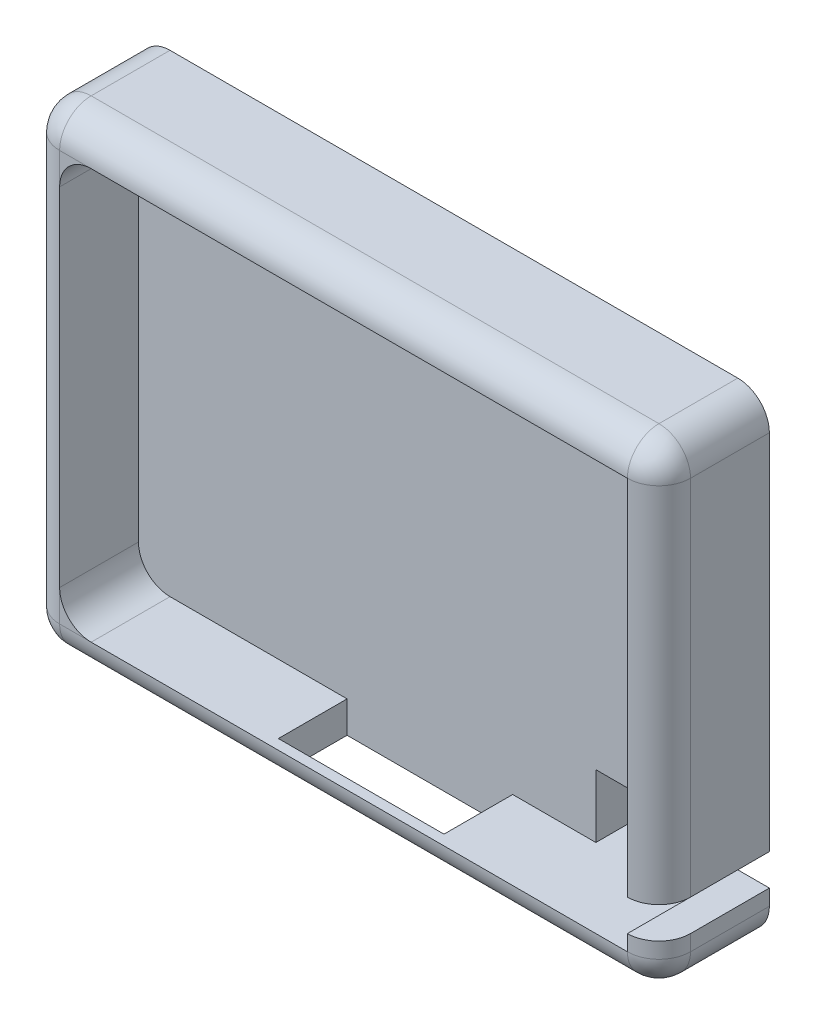
ISO-10303-21;
HEADER;
FILE_DESCRIPTION(('STEP AP214'),'2;1');
FILE_NAME('part.step','',(''),(''),'','','');
FILE_SCHEMA(('AUTOMOTIVE_DESIGN { 1 0 10303 214 1 1 1 1 }'));
ENDSEC;
DATA;
#1=APPLICATION_CONTEXT('core data for automotive mechanical design processes');
#2=APPLICATION_PROTOCOL_DEFINITION('international standard','automotive_design',2000,#1);
#3=PRODUCT_CONTEXT('',#1,'mechanical');
#4=PRODUCT('Part','Part','',(#3));
#5=PRODUCT_RELATED_PRODUCT_CATEGORY('part','',(#4));
#6=PRODUCT_DEFINITION_FORMATION('','',#4);
#7=PRODUCT_DEFINITION_CONTEXT('part definition',#1,'design');
#8=PRODUCT_DEFINITION('design','',#6,#7);
#9=PRODUCT_DEFINITION_SHAPE('','',#8);
#10=(LENGTH_UNIT() NAMED_UNIT(*) SI_UNIT(.MILLI.,.METRE.));
#11=(NAMED_UNIT(*) PLANE_ANGLE_UNIT() SI_UNIT($,.RADIAN.));
#12=(NAMED_UNIT(*) SI_UNIT($,.STERADIAN.) SOLID_ANGLE_UNIT());
#13=UNCERTAINTY_MEASURE_WITH_UNIT(LENGTH_MEASURE(1.E-05),#10,'distance_accuracy_value','');
#14=(GEOMETRIC_REPRESENTATION_CONTEXT(3) GLOBAL_UNCERTAINTY_ASSIGNED_CONTEXT((#13)) GLOBAL_UNIT_ASSIGNED_CONTEXT((#10,
#11,#12)) REPRESENTATION_CONTEXT('',''));
#15=CARTESIAN_POINT('',(0.,0.,0.));
#16=DIRECTION('',(0.,0.,1.));
#17=DIRECTION('',(1.,0.,0.));
#18=AXIS2_PLACEMENT_3D('',#15,#16,#17);
#19=CARTESIAN_POINT('',(40.,0.,7.));
#20=DIRECTION('',(-1.,0.,0.));
#21=DIRECTION('',(0.,0.,1.));
#22=AXIS2_PLACEMENT_3D('',#19,#20,#21);
#23=PLANE('',#22);
#24=DIRECTION('',(0.,1.,0.));
#25=VECTOR('',#24,1.);
#26=CARTESIAN_POINT('',(40.,0.,0.));
#27=LINE('',#26,#25);
#28=CARTESIAN_POINT('',(40.,2.,0.));
#29=VERTEX_POINT('',#28);
#30=CARTESIAN_POINT('',(40.,3.,0.));
#31=VERTEX_POINT('',#30);
#32=EDGE_CURVE('E290',#29,#31,#27,.T.);
#33=ORIENTED_EDGE('',*,*,#32,.T.);
#34=DIRECTION('',(0.,0.,-1.));
#35=VECTOR('',#34,1.);
#36=CARTESIAN_POINT('',(40.,3.,10.));
#37=LINE('',#36,#35);
#38=CARTESIAN_POINT('',(40.,3.,5.));
#39=VERTEX_POINT('',#38);
#40=EDGE_CURVE('E469',#39,#31,#37,.T.);
#41=ORIENTED_EDGE('',*,*,#40,.F.);
#42=DIRECTION('',(0.,1.,0.));
#43=VECTOR('',#42,1.);
#44=CARTESIAN_POINT('',(40.,0.,5.));
#45=LINE('',#44,#43);
#46=CARTESIAN_POINT('',(40.,2.,5.));
#47=VERTEX_POINT('',#46);
#48=EDGE_CURVE('E333',#39,#47,#45,.F.);
#49=ORIENTED_EDGE('',*,*,#48,.T.);
#50=DIRECTION('',(0.,0.,-1.));
#51=VECTOR('',#50,1.);
#52=CARTESIAN_POINT('',(40.,2.,7.));
#53=LINE('',#52,#51);
#54=EDGE_CURVE('E337',#47,#29,#53,.T.);
#55=ORIENTED_EDGE('',*,*,#54,.T.);
#56=EDGE_LOOP('',(#33,#41,#49,#55));
#57=FACE_BOUND('',#56,.T.);
#58=ADVANCED_FACE('F34',(#57),#23,.F.);
#59=CARTESIAN_POINT('',(38.,28.,2.));
#60=DIRECTION('',(1.,0.,0.));
#61=DIRECTION('',(0.,0.,-1.));
#62=AXIS2_PLACEMENT_3D('',#59,#60,#61);
#63=PLANE('',#62);
#64=DIRECTION('',(0.,1.,0.));
#65=VECTOR('',#64,1.);
#66=CARTESIAN_POINT('',(38.,28.,7.));
#67=LINE('',#66,#65);
#68=CARTESIAN_POINT('',(38.,2.,7.));
#69=VERTEX_POINT('',#68);
#70=CARTESIAN_POINT('',(38.,3.,7.));
#71=VERTEX_POINT('',#70);
#72=EDGE_CURVE('E268',#69,#71,#67,.T.);
#73=ORIENTED_EDGE('',*,*,#72,.T.);
#74=DIRECTION('',(0.,0.,-1.));
#75=VECTOR('',#74,1.);
#76=CARTESIAN_POINT('',(38.,3.,10.));
#77=LINE('',#76,#75);
#78=CARTESIAN_POINT('',(38.,3.,0.));
#79=VERTEX_POINT('',#78);
#80=EDGE_CURVE('E56',#71,#79,#77,.T.);
#81=ORIENTED_EDGE('',*,*,#80,.T.);
#82=DIRECTION('',(0.,1.,0.));
#83=VECTOR('',#82,1.);
#84=CARTESIAN_POINT('',(38.,2.,0.));
#85=LINE('',#84,#83);
#86=CARTESIAN_POINT('',(38.,2.,0.));
#87=VERTEX_POINT('',#86);
#88=EDGE_CURVE('E233',#87,#79,#85,.T.);
#89=ORIENTED_EDGE('',*,*,#88,.F.);
#90=DIRECTION('',(0.,0.,1.));
#91=VECTOR('',#90,1.);
#92=CARTESIAN_POINT('',(38.,2.,2.));
#93=LINE('',#92,#91);
#94=EDGE_CURVE('E279',#87,#69,#93,.T.);
#95=ORIENTED_EDGE('',*,*,#94,.T.);
#96=EDGE_LOOP('',(#73,#81,#89,#95));
#97=FACE_BOUND('',#96,.T.);
#98=ADVANCED_FACE('F467',(#97),#63,.F.);
#99=CARTESIAN_POINT('',(38.,0.,5.));
#100=DIRECTION('',(0.,1.,0.));
#101=DIRECTION('',(0.,0.,1.));
#102=AXIS2_PLACEMENT_3D('',#99,#100,#101);
#103=CYLINDRICAL_SURFACE('',#102,2.);
#104=CARTESIAN_POINT('',(38.,3.,5.));
#105=DIRECTION('',(0.,-1.,0.));
#106=DIRECTION('',(0.,0.,-1.));
#107=AXIS2_PLACEMENT_3D('',#104,#105,#106);
#108=CIRCLE('',#107,2.);
#109=EDGE_CURVE('E11',#71,#39,#108,.F.);
#110=ORIENTED_EDGE('',*,*,#109,.F.);
#111=ORIENTED_EDGE('',*,*,#72,.F.);
#112=CARTESIAN_POINT('',(38.,2.,5.));
#113=DIRECTION('',(0.,-1.,0.));
#114=DIRECTION('',(0.,0.,-1.));
#115=AXIS2_PLACEMENT_3D('',#112,#113,#114);
#116=CIRCLE('',#115,2.);
#117=EDGE_CURVE('E368',#47,#69,#116,.T.);
#118=ORIENTED_EDGE('',*,*,#117,.F.);
#119=ORIENTED_EDGE('',*,*,#48,.F.);
#120=EDGE_LOOP('',(#110,#111,#118,#119));
#121=FACE_BOUND('',#120,.T.);
#122=ADVANCED_FACE('F543',(#121),#103,.T.);
#123=CARTESIAN_POINT('',(0.,0.,7.));
#124=DIRECTION('',(0.,0.,-1.));
#125=DIRECTION('',(-1.,0.,0.));
#126=AXIS2_PLACEMENT_3D('',#123,#124,#125);
#127=PLANE('',#126);
#128=CARTESIAN_POINT('',(4.,26.,7.));
#129=DIRECTION('',(0.,0.,-1.));
#130=DIRECTION('',(-1.,0.,0.));
#131=AXIS2_PLACEMENT_3D('',#128,#129,#130);
#132=CIRCLE('',#131,2.);
#133=CARTESIAN_POINT('',(2.,26.,7.));
#134=VERTEX_POINT('',#133);
#135=CARTESIAN_POINT('',(4.,28.,7.));
#136=VERTEX_POINT('',#135);
#137=EDGE_CURVE('E312',#134,#136,#132,.T.);
#138=ORIENTED_EDGE('',*,*,#137,.T.);
#139=DIRECTION('',(-1.,0.,0.));
#140=VECTOR('',#139,1.);
#141=CARTESIAN_POINT('',(0.,28.,7.));
#142=LINE('',#141,#140);
#143=CARTESIAN_POINT('',(2.,28.,7.));
#144=VERTEX_POINT('',#143);
#145=EDGE_CURVE('E321',#136,#144,#142,.T.);
#146=ORIENTED_EDGE('',*,*,#145,.T.);
#147=DIRECTION('',(0.,-1.,0.));
#148=VECTOR('',#147,1.);
#149=CARTESIAN_POINT('',(2.,0.,7.));
#150=LINE('',#149,#148);
#151=EDGE_CURVE('E319',#144,#134,#150,.T.);
#152=ORIENTED_EDGE('',*,*,#151,.T.);
#153=EDGE_LOOP('',(#138,#146,#152));
#154=FACE_BOUND('',#153,.T.);
#155=ADVANCED_FACE('F519',(#154),#127,.F.);
#156=CARTESIAN_POINT('',(0.,0.,7.));
#157=DIRECTION('',(1.,0.,0.));
#158=DIRECTION('',(0.,0.,-1.));
#159=AXIS2_PLACEMENT_3D('',#156,#157,#158);
#160=PLANE('',#159);
#161=DIRECTION('',(0.,-1.,0.));
#162=VECTOR('',#161,1.);
#163=CARTESIAN_POINT('',(0.,0.,0.));
#164=LINE('',#163,#162);
#165=CARTESIAN_POINT('',(0.,28.,0.));
#166=VERTEX_POINT('',#165);
#167=CARTESIAN_POINT('',(0.,2.,0.));
#168=VERTEX_POINT('',#167);
#169=EDGE_CURVE('E282',#166,#168,#164,.T.);
#170=ORIENTED_EDGE('',*,*,#169,.T.);
#171=DIRECTION('',(0.,0.,-1.));
#172=VECTOR('',#171,1.);
#173=CARTESIAN_POINT('',(0.,2.,7.));
#174=LINE('',#173,#172);
#175=CARTESIAN_POINT('',(0.,2.,5.));
#176=VERTEX_POINT('',#175);
#177=EDGE_CURVE('E349',#168,#176,#174,.F.);
#178=ORIENTED_EDGE('',*,*,#177,.T.);
#179=DIRECTION('',(0.,-1.,0.));
#180=VECTOR('',#179,1.);
#181=CARTESIAN_POINT('',(0.,0.,5.));
#182=LINE('',#181,#180);
#183=CARTESIAN_POINT('',(0.,28.,5.));
#184=VERTEX_POINT('',#183);
#185=EDGE_CURVE('E347',#176,#184,#182,.F.);
#186=ORIENTED_EDGE('',*,*,#185,.T.);
#187=DIRECTION('',(0.,0.,-1.));
#188=VECTOR('',#187,1.);
#189=CARTESIAN_POINT('',(0.,28.,7.));
#190=LINE('',#189,#188);
#191=EDGE_CURVE('E345',#184,#166,#190,.T.);
#192=ORIENTED_EDGE('',*,*,#191,.T.);
#193=EDGE_LOOP('',(#170,#178,#186,#192));
#194=FACE_BOUND('',#193,.T.);
#195=ADVANCED_FACE('F576',(#194),#160,.F.);
#196=CARTESIAN_POINT('',(0.,0.,7.));
#197=DIRECTION('',(0.,1.,0.));
#198=DIRECTION('',(0.,0.,1.));
#199=AXIS2_PLACEMENT_3D('',#196,#197,#198);
#200=PLANE('',#199);
#201=DIRECTION('',(1.,0.,0.));
#202=VECTOR('',#201,1.);
#203=CARTESIAN_POINT('',(0.,0.,5.));
#204=LINE('',#203,#202);
#205=CARTESIAN_POINT('',(38.,0.,5.));
#206=VERTEX_POINT('',#205);
#207=CARTESIAN_POINT('',(25.7257710311441,0.,5.));
#208=VERTEX_POINT('',#207);
#209=EDGE_CURVE('E326',#206,#208,#204,.F.);
#210=ORIENTED_EDGE('',*,*,#209,.T.);
#211=DIRECTION('',(0.,0.,1.));
#212=VECTOR('',#211,1.);
#213=CARTESIAN_POINT('',(25.7257710311441,0.,2.));
#214=LINE('',#213,#212);
#215=CARTESIAN_POINT('',(25.7257710311441,0.,2.));
#216=VERTEX_POINT('',#215);
#217=EDGE_CURVE('E408',#216,#208,#214,.T.);
#218=ORIENTED_EDGE('',*,*,#217,.F.);
#219=DIRECTION('',(1.,0.,0.));
#220=VECTOR('',#219,1.);
#221=CARTESIAN_POINT('',(15.2257710311441,0.,2.));
#222=LINE('',#221,#220);
#223=CARTESIAN_POINT('',(15.2257710311441,0.,2.));
#224=VERTEX_POINT('',#223);
#225=EDGE_CURVE('E431',#224,#216,#222,.T.);
#226=ORIENTED_EDGE('',*,*,#225,.F.);
#227=DIRECTION('',(0.,0.,-1.));
#228=VECTOR('',#227,1.);
#229=CARTESIAN_POINT('',(15.2257710311441,0.,2.));
#230=LINE('',#229,#228);
#231=CARTESIAN_POINT('',(15.2257710311441,0.,5.));
#232=VERTEX_POINT('',#231);
#233=EDGE_CURVE('E418',#232,#224,#230,.T.);
#234=ORIENTED_EDGE('',*,*,#233,.F.);
#235=CARTESIAN_POINT('',(2.,0.,5.));
#236=VERTEX_POINT('',#235);
#237=EDGE_CURVE('E325',#232,#236,#204,.F.);
#238=ORIENTED_EDGE('',*,*,#237,.T.);
#239=DIRECTION('',(0.,0.,-1.));
#240=VECTOR('',#239,1.);
#241=CARTESIAN_POINT('',(2.,0.,7.));
#242=LINE('',#241,#240);
#243=CARTESIAN_POINT('',(2.,0.,0.));
#244=VERTEX_POINT('',#243);
#245=EDGE_CURVE('E329',#236,#244,#242,.T.);
#246=ORIENTED_EDGE('',*,*,#245,.T.);
#247=DIRECTION('',(1.,0.,0.));
#248=VECTOR('',#247,1.);
#249=CARTESIAN_POINT('',(0.,0.,0.));
#250=LINE('',#249,#248);
#251=CARTESIAN_POINT('',(38.,0.,0.));
#252=VERTEX_POINT('',#251);
#253=EDGE_CURVE('E287',#244,#252,#250,.T.);
#254=ORIENTED_EDGE('',*,*,#253,.T.);
#255=DIRECTION('',(0.,0.,-1.));
#256=VECTOR('',#255,1.);
#257=CARTESIAN_POINT('',(38.,0.,7.));
#258=LINE('',#257,#256);
#259=EDGE_CURVE('E323',#252,#206,#258,.F.);
#260=ORIENTED_EDGE('',*,*,#259,.T.);
#261=EDGE_LOOP('',(#210,#218,#226,#234,#238,#246,#254,#260));
#262=FACE_BOUND('',#261,.T.);
#263=ADVANCED_FACE('F430',(#262),#200,.F.);
#264=CARTESIAN_POINT('',(40.,28.,5.));
#265=VERTEX_POINT('',#264);
#266=CARTESIAN_POINT('',(40.,5.,5.));
#267=VERTEX_POINT('',#266);
#268=EDGE_CURVE('E334',#265,#267,#45,.F.);
#269=ORIENTED_EDGE('',*,*,#268,.T.);
#270=DIRECTION('',(0.,0.,-1.));
#271=VECTOR('',#270,1.);
#272=CARTESIAN_POINT('',(40.,5.,10.));
#273=LINE('',#272,#271);
#274=CARTESIAN_POINT('',(40.,5.,0.));
#275=VERTEX_POINT('',#274);
#276=EDGE_CURVE('E49',#267,#275,#273,.T.);
#277=ORIENTED_EDGE('',*,*,#276,.T.);
#278=CARTESIAN_POINT('',(40.,28.,0.));
#279=VERTEX_POINT('',#278);
#280=EDGE_CURVE('E227',#275,#279,#27,.T.);
#281=ORIENTED_EDGE('',*,*,#280,.T.);
#282=DIRECTION('',(0.,0.,-1.));
#283=VECTOR('',#282,1.);
#284=CARTESIAN_POINT('',(40.,28.,7.));
#285=LINE('',#284,#283);
#286=EDGE_CURVE('E331',#279,#265,#285,.F.);
#287=ORIENTED_EDGE('',*,*,#286,.T.);
#288=EDGE_LOOP('',(#269,#277,#281,#287));
#289=FACE_BOUND('',#288,.T.);
#290=ADVANCED_FACE('F474',(#289),#23,.F.);
#291=CARTESIAN_POINT('',(0.,30.,7.));
#292=DIRECTION('',(0.,-1.,0.));
#293=DIRECTION('',(0.,0.,-1.));
#294=AXIS2_PLACEMENT_3D('',#291,#292,#293);
#295=PLANE('',#294);
#296=DIRECTION('',(-1.,0.,0.));
#297=VECTOR('',#296,1.);
#298=CARTESIAN_POINT('',(0.,30.,5.));
#299=LINE('',#298,#297);
#300=CARTESIAN_POINT('',(2.,30.,5.));
#301=VERTEX_POINT('',#300);
#302=CARTESIAN_POINT('',(38.,30.,5.));
#303=VERTEX_POINT('',#302);
#304=EDGE_CURVE('E341',#301,#303,#299,.F.);
#305=ORIENTED_EDGE('',*,*,#304,.T.);
#306=DIRECTION('',(0.,0.,-1.));
#307=VECTOR('',#306,1.);
#308=CARTESIAN_POINT('',(38.,30.,7.));
#309=LINE('',#308,#307);
#310=CARTESIAN_POINT('',(38.,30.,0.));
#311=VERTEX_POINT('',#310);
#312=EDGE_CURVE('E343',#303,#311,#309,.T.);
#313=ORIENTED_EDGE('',*,*,#312,.T.);
#314=DIRECTION('',(-1.,0.,0.));
#315=VECTOR('',#314,1.);
#316=CARTESIAN_POINT('',(0.,30.,0.));
#317=LINE('',#316,#315);
#318=CARTESIAN_POINT('',(2.,30.,0.));
#319=VERTEX_POINT('',#318);
#320=EDGE_CURVE('E293',#311,#319,#317,.T.);
#321=ORIENTED_EDGE('',*,*,#320,.T.);
#322=DIRECTION('',(0.,0.,-1.));
#323=VECTOR('',#322,1.);
#324=CARTESIAN_POINT('',(2.,30.,7.));
#325=LINE('',#324,#323);
#326=EDGE_CURVE('E339',#319,#301,#325,.F.);
#327=ORIENTED_EDGE('',*,*,#326,.T.);
#328=EDGE_LOOP('',(#305,#313,#321,#327));
#329=FACE_BOUND('',#328,.T.);
#330=ADVANCED_FACE('F501',(#329),#295,.F.);
#331=DIRECTION('',(0.,-1.,0.));
#332=VECTOR('',#331,1.);
#333=CARTESIAN_POINT('',(2.,0.,7.));
#334=LINE('',#333,#332);
#335=CARTESIAN_POINT('',(2.,4.,7.));
#336=VERTEX_POINT('',#335);
#337=CARTESIAN_POINT('',(2.,2.,7.));
#338=VERTEX_POINT('',#337);
#339=EDGE_CURVE('E314',#336,#338,#334,.T.);
#340=ORIENTED_EDGE('',*,*,#339,.T.);
#341=DIRECTION('',(1.,0.,0.));
#342=VECTOR('',#341,1.);
#343=CARTESIAN_POINT('',(0.,2.,7.));
#344=LINE('',#343,#342);
#345=CARTESIAN_POINT('',(4.,2.,7.));
#346=VERTEX_POINT('',#345);
#347=EDGE_CURVE('E316',#338,#346,#344,.T.);
#348=ORIENTED_EDGE('',*,*,#347,.T.);
#349=CARTESIAN_POINT('',(4.,4.,7.));
#350=DIRECTION('',(0.,0.,-1.));
#351=DIRECTION('',(-1.,0.,0.));
#352=AXIS2_PLACEMENT_3D('',#349,#350,#351);
#353=CIRCLE('',#352,2.);
#354=EDGE_CURVE('E310',#346,#336,#353,.T.);
#355=ORIENTED_EDGE('',*,*,#354,.T.);
#356=EDGE_LOOP('',(#340,#348,#355));
#357=FACE_BOUND('',#356,.T.);
#358=ADVANCED_FACE('F575',(#357),#127,.F.);
#359=CARTESIAN_POINT('',(0.,0.,0.));
#360=DIRECTION('',(0.,0.,-1.));
#361=DIRECTION('',(-1.,0.,0.));
#362=AXIS2_PLACEMENT_3D('',#359,#360,#361);
#363=PLANE('',#362);
#364=DIRECTION('',(-1.,0.,0.));
#365=VECTOR('',#364,1.);
#366=CARTESIAN_POINT('',(38.,3.,0.));
#367=LINE('',#366,#365);
#368=EDGE_CURVE('E217',#31,#79,#367,.T.);
#369=ORIENTED_EDGE('',*,*,#368,.F.);
#370=ORIENTED_EDGE('',*,*,#32,.F.);
#371=CARTESIAN_POINT('',(38.,2.,0.));
#372=DIRECTION('',(0.,0.,-1.));
#373=DIRECTION('',(-1.,0.,0.));
#374=AXIS2_PLACEMENT_3D('',#371,#372,#373);
#375=CIRCLE('',#374,2.);
#376=EDGE_CURVE('E355',#29,#252,#375,.T.);
#377=ORIENTED_EDGE('',*,*,#376,.T.);
#378=ORIENTED_EDGE('',*,*,#253,.F.);
#379=CARTESIAN_POINT('',(2.,2.,0.));
#380=DIRECTION('',(0.,0.,-1.));
#381=DIRECTION('',(-1.,0.,0.));
#382=AXIS2_PLACEMENT_3D('',#379,#380,#381);
#383=CIRCLE('',#382,2.);
#384=EDGE_CURVE('E357',#244,#168,#383,.T.);
#385=ORIENTED_EDGE('',*,*,#384,.T.);
#386=ORIENTED_EDGE('',*,*,#169,.F.);
#387=CARTESIAN_POINT('',(2.,28.,0.));
#388=DIRECTION('',(0.,0.,-1.));
#389=DIRECTION('',(-1.,0.,0.));
#390=AXIS2_PLACEMENT_3D('',#387,#388,#389);
#391=CIRCLE('',#390,2.);
#392=EDGE_CURVE('E351',#166,#319,#391,.T.);
#393=ORIENTED_EDGE('',*,*,#392,.T.);
#394=ORIENTED_EDGE('',*,*,#320,.F.);
#395=CARTESIAN_POINT('',(38.,28.,0.));
#396=DIRECTION('',(0.,0.,-1.));
#397=DIRECTION('',(-1.,0.,0.));
#398=AXIS2_PLACEMENT_3D('',#395,#396,#397);
#399=CIRCLE('',#398,2.);
#400=EDGE_CURVE('E353',#311,#279,#399,.T.);
#401=ORIENTED_EDGE('',*,*,#400,.T.);
#402=ORIENTED_EDGE('',*,*,#280,.F.);
#403=DIRECTION('',(1.,0.,0.));
#404=VECTOR('',#403,1.);
#405=CARTESIAN_POINT('',(38.,5.,0.));
#406=LINE('',#405,#404);
#407=CARTESIAN_POINT('',(38.,5.,0.));
#408=VERTEX_POINT('',#407);
#409=EDGE_CURVE('E213',#408,#275,#406,.T.);
#410=ORIENTED_EDGE('',*,*,#409,.F.);
#411=CARTESIAN_POINT('',(38.,6.,0.));
#412=VERTEX_POINT('',#411);
#413=EDGE_CURVE('E224',#408,#412,#85,.T.);
#414=ORIENTED_EDGE('',*,*,#413,.T.);
#415=DIRECTION('',(-1.,0.,0.));
#416=VECTOR('',#415,1.);
#417=CARTESIAN_POINT('',(38.,6.,0.));
#418=LINE('',#417,#416);
#419=CARTESIAN_POINT('',(31.,6.,0.));
#420=VERTEX_POINT('',#419);
#421=EDGE_CURVE('E241',#412,#420,#418,.T.);
#422=ORIENTED_EDGE('',*,*,#421,.T.);
#423=DIRECTION('',(0.,-1.,0.));
#424=VECTOR('',#423,1.);
#425=CARTESIAN_POINT('',(31.,2.,0.));
#426=LINE('',#425,#424);
#427=CARTESIAN_POINT('',(31.,2.,0.));
#428=VERTEX_POINT('',#427);
#429=EDGE_CURVE('E244',#420,#428,#426,.T.);
#430=ORIENTED_EDGE('',*,*,#429,.T.);
#431=DIRECTION('',(1.,0.,0.));
#432=VECTOR('',#431,1.);
#433=CARTESIAN_POINT('',(38.,2.,0.));
#434=LINE('',#433,#432);
#435=EDGE_CURVE('E234',#428,#87,#434,.T.);
#436=ORIENTED_EDGE('',*,*,#435,.T.);
#437=ORIENTED_EDGE('',*,*,#88,.T.);
#438=EDGE_LOOP('',(#369,#370,#377,#378,#385,#386,#393,#394,#401,#402,#410,#414,#422,#430,#436,#437));
#439=FACE_BOUND('',#438,.T.);
#440=ADVANCED_FACE('F222',(#439),#363,.T.);
#441=ORIENTED_EDGE('',*,*,#413,.F.);
#442=DIRECTION('',(0.,0.,-1.));
#443=VECTOR('',#442,1.);
#444=CARTESIAN_POINT('',(38.,5.,10.));
#445=LINE('',#444,#443);
#446=CARTESIAN_POINT('',(38.,5.,7.));
#447=VERTEX_POINT('',#446);
#448=EDGE_CURVE('E210',#447,#408,#445,.T.);
#449=ORIENTED_EDGE('',*,*,#448,.F.);
#450=CARTESIAN_POINT('',(38.,28.,7.));
#451=VERTEX_POINT('',#450);
#452=EDGE_CURVE('E272',#447,#451,#67,.T.);
#453=ORIENTED_EDGE('',*,*,#452,.T.);
#454=DIRECTION('',(0.,0.,1.));
#455=VECTOR('',#454,1.);
#456=CARTESIAN_POINT('',(38.,28.,2.));
#457=LINE('',#456,#455);
#458=CARTESIAN_POINT('',(38.,28.,2.));
#459=VERTEX_POINT('',#458);
#460=EDGE_CURVE('E267',#459,#451,#457,.T.);
#461=ORIENTED_EDGE('',*,*,#460,.F.);
#462=DIRECTION('',(0.,1.,0.));
#463=VECTOR('',#462,1.);
#464=CARTESIAN_POINT('',(38.,28.,2.));
#465=LINE('',#464,#463);
#466=CARTESIAN_POINT('',(38.,6.,2.));
#467=VERTEX_POINT('',#466);
#468=EDGE_CURVE('E254',#467,#459,#465,.T.);
#469=ORIENTED_EDGE('',*,*,#468,.F.);
#470=DIRECTION('',(0.,0.,1.));
#471=VECTOR('',#470,1.);
#472=CARTESIAN_POINT('',(38.,6.,-8.06225774829855));
#473=LINE('',#472,#471);
#474=EDGE_CURVE('E231',#412,#467,#473,.T.);
#475=ORIENTED_EDGE('',*,*,#474,.F.);
#476=EDGE_LOOP('',(#441,#449,#453,#461,#469,#475));
#477=FACE_BOUND('',#476,.T.);
#478=ADVANCED_FACE('F229',(#477),#63,.F.);
#479=CARTESIAN_POINT('',(2.,2.,2.));
#480=DIRECTION('',(0.,-1.,0.));
#481=DIRECTION('',(0.,0.,-1.));
#482=AXIS2_PLACEMENT_3D('',#479,#480,#481);
#483=PLANE('',#482);
#484=DIRECTION('',(1.,0.,0.));
#485=VECTOR('',#484,1.);
#486=CARTESIAN_POINT('',(2.,2.,2.));
#487=LINE('',#486,#485);
#488=CARTESIAN_POINT('',(25.7257710311441,2.,2.));
#489=VERTEX_POINT('',#488);
#490=CARTESIAN_POINT('',(31.,2.,2.));
#491=VERTEX_POINT('',#490);
#492=EDGE_CURVE('E263',#489,#491,#487,.T.);
#493=ORIENTED_EDGE('',*,*,#492,.F.);
#494=DIRECTION('',(0.,0.,-1.));
#495=VECTOR('',#494,1.);
#496=CARTESIAN_POINT('',(25.7257710311441,2.,2.));
#497=LINE('',#496,#495);
#498=CARTESIAN_POINT('',(25.7257710311441,2.,6.35598047435966));
#499=VERTEX_POINT('',#498);
#500=EDGE_CURVE('E436',#499,#489,#497,.T.);
#501=ORIENTED_EDGE('',*,*,#500,.F.);
#502=DIRECTION('',(1.,0.,0.));
#503=VECTOR('',#502,1.);
#504=CARTESIAN_POINT('',(15.2257710311441,2.,6.35598047435966));
#505=LINE('',#504,#503);
#506=CARTESIAN_POINT('',(15.2257710311441,2.,6.35598047435966));
#507=VERTEX_POINT('',#506);
#508=EDGE_CURVE('E416',#507,#499,#505,.T.);
#509=ORIENTED_EDGE('',*,*,#508,.F.);
#510=DIRECTION('',(0.,0.,1.));
#511=VECTOR('',#510,1.);
#512=CARTESIAN_POINT('',(15.2257710311441,2.,2.));
#513=LINE('',#512,#511);
#514=CARTESIAN_POINT('',(15.2257710311441,2.,2.));
#515=VERTEX_POINT('',#514);
#516=EDGE_CURVE('E438',#515,#507,#513,.T.);
#517=ORIENTED_EDGE('',*,*,#516,.F.);
#518=CARTESIAN_POINT('',(4.,2.,2.));
#519=VERTEX_POINT('',#518);
#520=EDGE_CURVE('E264',#519,#515,#487,.T.);
#521=ORIENTED_EDGE('',*,*,#520,.F.);
#522=DIRECTION('',(0.,0.,1.));
#523=VECTOR('',#522,1.);
#524=CARTESIAN_POINT('',(4.,2.,7.));
#525=LINE('',#524,#523);
#526=EDGE_CURVE('E296',#519,#346,#525,.T.);
#527=ORIENTED_EDGE('',*,*,#526,.T.);
#528=DIRECTION('',(1.,0.,0.));
#529=VECTOR('',#528,1.);
#530=CARTESIAN_POINT('',(2.,2.,7.));
#531=LINE('',#530,#529);
#532=EDGE_CURVE('E257',#346,#69,#531,.T.);
#533=ORIENTED_EDGE('',*,*,#532,.T.);
#534=ORIENTED_EDGE('',*,*,#94,.F.);
#535=ORIENTED_EDGE('',*,*,#435,.F.);
#536=DIRECTION('',(0.,0.,1.));
#537=VECTOR('',#536,1.);
#538=CARTESIAN_POINT('',(31.,2.,-8.06225774829855));
#539=LINE('',#538,#537);
#540=EDGE_CURVE('E238',#428,#491,#539,.T.);
#541=ORIENTED_EDGE('',*,*,#540,.T.);
#542=EDGE_LOOP('',(#493,#501,#509,#517,#521,#527,#533,#534,#535,#541));
#543=FACE_BOUND('',#542,.T.);
#544=ADVANCED_FACE('F463',(#543),#483,.F.);
#545=CARTESIAN_POINT('',(2.,28.,2.));
#546=DIRECTION('',(-1.,0.,0.));
#547=DIRECTION('',(0.,-1.,0.));
#548=AXIS2_PLACEMENT_3D('',#545,#546,#547);
#549=PLANE('',#548);
#550=DIRECTION('',(0.,-1.,0.));
#551=VECTOR('',#550,1.);
#552=CARTESIAN_POINT('',(2.,28.,7.));
#553=LINE('',#552,#551);
#554=EDGE_CURVE('E275',#134,#336,#553,.T.);
#555=ORIENTED_EDGE('',*,*,#554,.T.);
#556=DIRECTION('',(0.,0.,1.));
#557=VECTOR('',#556,1.);
#558=CARTESIAN_POINT('',(2.,4.,2.));
#559=LINE('',#558,#557);
#560=CARTESIAN_POINT('',(2.,4.,2.));
#561=VERTEX_POINT('',#560);
#562=EDGE_CURVE('E302',#336,#561,#559,.F.);
#563=ORIENTED_EDGE('',*,*,#562,.T.);
#564=DIRECTION('',(0.,-1.,0.));
#565=VECTOR('',#564,1.);
#566=CARTESIAN_POINT('',(2.,28.,2.));
#567=LINE('',#566,#565);
#568=CARTESIAN_POINT('',(2.,26.,2.));
#569=VERTEX_POINT('',#568);
#570=EDGE_CURVE('E260',#569,#561,#567,.T.);
#571=ORIENTED_EDGE('',*,*,#570,.F.);
#572=DIRECTION('',(0.,0.,1.));
#573=VECTOR('',#572,1.);
#574=CARTESIAN_POINT('',(2.,26.,7.));
#575=LINE('',#574,#573);
#576=EDGE_CURVE('E299',#569,#134,#575,.T.);
#577=ORIENTED_EDGE('',*,*,#576,.T.);
#578=EDGE_LOOP('',(#555,#563,#571,#577));
#579=FACE_BOUND('',#578,.T.);
#580=ADVANCED_FACE('F526',(#579),#549,.F.);
#581=CARTESIAN_POINT('',(2.,28.,2.));
#582=DIRECTION('',(0.,1.,0.));
#583=DIRECTION('',(0.,0.,1.));
#584=AXIS2_PLACEMENT_3D('',#581,#582,#583);
#585=PLANE('',#584);
#586=DIRECTION('',(-1.,0.,0.));
#587=VECTOR('',#586,1.);
#588=CARTESIAN_POINT('',(2.,28.,7.));
#589=LINE('',#588,#587);
#590=EDGE_CURVE('E271',#451,#136,#589,.T.);
#591=ORIENTED_EDGE('',*,*,#590,.T.);
#592=DIRECTION('',(0.,0.,1.));
#593=VECTOR('',#592,1.);
#594=CARTESIAN_POINT('',(4.,28.,2.));
#595=LINE('',#594,#593);
#596=CARTESIAN_POINT('',(4.,28.,2.));
#597=VERTEX_POINT('',#596);
#598=EDGE_CURVE('E308',#136,#597,#595,.F.);
#599=ORIENTED_EDGE('',*,*,#598,.T.);
#600=DIRECTION('',(-1.,0.,0.));
#601=VECTOR('',#600,1.);
#602=CARTESIAN_POINT('',(2.,28.,2.));
#603=LINE('',#602,#601);
#604=EDGE_CURVE('E256',#459,#597,#603,.T.);
#605=ORIENTED_EDGE('',*,*,#604,.F.);
#606=ORIENTED_EDGE('',*,*,#460,.T.);
#607=EDGE_LOOP('',(#591,#599,#605,#606));
#608=FACE_BOUND('',#607,.T.);
#609=ADVANCED_FACE('F485',(#608),#585,.F.);
#610=CARTESIAN_POINT('',(0.,0.,2.));
#611=DIRECTION('',(0.,0.,1.));
#612=DIRECTION('',(1.,0.,0.));
#613=AXIS2_PLACEMENT_3D('',#610,#611,#612);
#614=PLANE('',#613);
#615=DIRECTION('',(-1.,0.,0.));
#616=VECTOR('',#615,1.);
#617=CARTESIAN_POINT('',(38.,6.,2.));
#618=LINE('',#617,#616);
#619=CARTESIAN_POINT('',(31.,6.,2.));
#620=VERTEX_POINT('',#619);
#621=EDGE_CURVE('E448',#467,#620,#618,.T.);
#622=ORIENTED_EDGE('',*,*,#621,.F.);
#623=ORIENTED_EDGE('',*,*,#468,.T.);
#624=ORIENTED_EDGE('',*,*,#604,.T.);
#625=CARTESIAN_POINT('',(4.,26.,2.));
#626=DIRECTION('',(0.,0.,1.));
#627=DIRECTION('',(1.,0.,0.));
#628=AXIS2_PLACEMENT_3D('',#625,#626,#627);
#629=CIRCLE('',#628,2.);
#630=EDGE_CURVE('E304',#597,#569,#629,.T.);
#631=ORIENTED_EDGE('',*,*,#630,.T.);
#632=ORIENTED_EDGE('',*,*,#570,.T.);
#633=CARTESIAN_POINT('',(4.,4.,2.));
#634=DIRECTION('',(0.,0.,1.));
#635=DIRECTION('',(1.,0.,0.));
#636=AXIS2_PLACEMENT_3D('',#633,#634,#635);
#637=CIRCLE('',#636,2.);
#638=EDGE_CURVE('E306',#561,#519,#637,.T.);
#639=ORIENTED_EDGE('',*,*,#638,.T.);
#640=ORIENTED_EDGE('',*,*,#520,.T.);
#641=DIRECTION('',(0.,1.,0.));
#642=VECTOR('',#641,1.);
#643=CARTESIAN_POINT('',(15.2257710311441,-11.3676983551202,2.));
#644=LINE('',#643,#642);
#645=EDGE_CURVE('E443',#224,#515,#644,.T.);
#646=ORIENTED_EDGE('',*,*,#645,.F.);
#647=ORIENTED_EDGE('',*,*,#225,.T.);
#648=DIRECTION('',(0.,1.,0.));
#649=VECTOR('',#648,1.);
#650=CARTESIAN_POINT('',(25.7257710311441,-11.3676983551202,2.));
#651=LINE('',#650,#649);
#652=EDGE_CURVE('E440',#216,#489,#651,.T.);
#653=ORIENTED_EDGE('',*,*,#652,.T.);
#654=ORIENTED_EDGE('',*,*,#492,.T.);
#655=DIRECTION('',(0.,-1.,0.));
#656=VECTOR('',#655,1.);
#657=CARTESIAN_POINT('',(31.,2.,2.));
#658=LINE('',#657,#656);
#659=EDGE_CURVE('E449',#620,#491,#658,.T.);
#660=ORIENTED_EDGE('',*,*,#659,.F.);
#661=EDGE_LOOP('',(#622,#623,#624,#631,#632,#639,#640,#646,#647,#653,#654,#660));
#662=FACE_BOUND('',#661,.T.);
#663=ADVANCED_FACE('F460',(#662),#614,.T.);
#664=CARTESIAN_POINT('',(4.,4.,2.));
#665=DIRECTION('',(0.,0.,-1.));
#666=DIRECTION('',(-1.,0.,0.));
#667=AXIS2_PLACEMENT_3D('',#664,#665,#666);
#668=CYLINDRICAL_SURFACE('',#667,2.);
#669=ORIENTED_EDGE('',*,*,#638,.F.);
#670=ORIENTED_EDGE('',*,*,#562,.F.);
#671=ORIENTED_EDGE('',*,*,#354,.F.);
#672=ORIENTED_EDGE('',*,*,#526,.F.);
#673=EDGE_LOOP('',(#669,#670,#671,#672));
#674=FACE_BOUND('',#673,.T.);
#675=ADVANCED_FACE('F532',(#674),#668,.F.);
#676=CARTESIAN_POINT('',(4.,26.,2.));
#677=DIRECTION('',(0.,0.,-1.));
#678=DIRECTION('',(-1.,0.,0.));
#679=AXIS2_PLACEMENT_3D('',#676,#677,#678);
#680=CYLINDRICAL_SURFACE('',#679,2.);
#681=ORIENTED_EDGE('',*,*,#630,.F.);
#682=ORIENTED_EDGE('',*,*,#598,.F.);
#683=ORIENTED_EDGE('',*,*,#137,.F.);
#684=ORIENTED_EDGE('',*,*,#576,.F.);
#685=EDGE_LOOP('',(#681,#682,#683,#684));
#686=FACE_BOUND('',#685,.T.);
#687=ADVANCED_FACE('F523',(#686),#680,.F.);
#688=CARTESIAN_POINT('',(2.,28.,7.));
#689=DIRECTION('',(0.,0.,-1.));
#690=DIRECTION('',(-1.,0.,0.));
#691=AXIS2_PLACEMENT_3D('',#688,#689,#690);
#692=CYLINDRICAL_SURFACE('',#691,2.);
#693=ORIENTED_EDGE('',*,*,#392,.F.);
#694=ORIENTED_EDGE('',*,*,#191,.F.);
#695=CARTESIAN_POINT('',(2.,28.,5.));
#696=DIRECTION('',(0.,0.,1.));
#697=DIRECTION('',(1.,0.,0.));
#698=AXIS2_PLACEMENT_3D('',#695,#696,#697);
#699=CIRCLE('',#698,2.);
#700=EDGE_CURVE('E392',#301,#184,#699,.T.);
#701=ORIENTED_EDGE('',*,*,#700,.F.);
#702=ORIENTED_EDGE('',*,*,#326,.F.);
#703=EDGE_LOOP('',(#693,#694,#701,#702));
#704=FACE_BOUND('',#703,.T.);
#705=ADVANCED_FACE('F36',(#704),#692,.T.);
#706=CARTESIAN_POINT('',(0.,28.,5.));
#707=DIRECTION('',(-1.,0.,0.));
#708=DIRECTION('',(0.,0.,1.));
#709=AXIS2_PLACEMENT_3D('',#706,#707,#708);
#710=CYLINDRICAL_SURFACE('',#709,2.);
#711=CARTESIAN_POINT('',(38.,28.,5.));
#712=DIRECTION('',(1.,0.,0.));
#713=DIRECTION('',(0.,0.,-1.));
#714=AXIS2_PLACEMENT_3D('',#711,#712,#713);
#715=CIRCLE('',#714,2.);
#716=EDGE_CURVE('E386',#303,#451,#715,.T.);
#717=ORIENTED_EDGE('',*,*,#716,.F.);
#718=ORIENTED_EDGE('',*,*,#304,.F.);
#719=CARTESIAN_POINT('',(2.,28.,5.));
#720=DIRECTION('',(-1.,0.,0.));
#721=DIRECTION('',(0.,0.,1.));
#722=AXIS2_PLACEMENT_3D('',#719,#720,#721);
#723=CIRCLE('',#722,2.);
#724=EDGE_CURVE('E389',#144,#301,#723,.T.);
#725=ORIENTED_EDGE('',*,*,#724,.F.);
#726=ORIENTED_EDGE('',*,*,#145,.F.);
#727=ORIENTED_EDGE('',*,*,#590,.F.);
#728=EDGE_LOOP('',(#717,#718,#725,#726,#727));
#729=FACE_BOUND('',#728,.T.);
#730=ADVANCED_FACE('F490',(#729),#710,.T.);
#731=CARTESIAN_POINT('',(38.,28.,7.));
#732=DIRECTION('',(0.,0.,-1.));
#733=DIRECTION('',(-1.,0.,0.));
#734=AXIS2_PLACEMENT_3D('',#731,#732,#733);
#735=CYLINDRICAL_SURFACE('',#734,2.);
#736=ORIENTED_EDGE('',*,*,#400,.F.);
#737=ORIENTED_EDGE('',*,*,#312,.F.);
#738=CARTESIAN_POINT('',(38.,28.,5.));
#739=DIRECTION('',(0.,0.,1.));
#740=DIRECTION('',(1.,0.,0.));
#741=AXIS2_PLACEMENT_3D('',#738,#739,#740);
#742=CIRCLE('',#741,2.);
#743=EDGE_CURVE('E383',#265,#303,#742,.T.);
#744=ORIENTED_EDGE('',*,*,#743,.F.);
#745=ORIENTED_EDGE('',*,*,#286,.F.);
#746=EDGE_LOOP('',(#736,#737,#744,#745));
#747=FACE_BOUND('',#746,.T.);
#748=ADVANCED_FACE('F498',(#747),#735,.T.);
#749=CARTESIAN_POINT('',(2.,28.,5.));
#750=DIRECTION('',(0.,0.,1.));
#751=DIRECTION('',(1.,0.,0.));
#752=AXIS2_PLACEMENT_3D('',#749,#750,#751);
#753=SPHERICAL_SURFACE('',#752,2.);
#754=ORIENTED_EDGE('',*,*,#724,.T.);
#755=ORIENTED_EDGE('',*,*,#700,.T.);
#756=CARTESIAN_POINT('',(2.,28.,5.));
#757=DIRECTION('',(0.,1.,0.));
#758=DIRECTION('',(0.,0.,1.));
#759=AXIS2_PLACEMENT_3D('',#756,#757,#758);
#760=CIRCLE('',#759,2.);
#761=EDGE_CURVE('E380',#144,#184,#760,.F.);
#762=ORIENTED_EDGE('',*,*,#761,.F.);
#763=EDGE_LOOP('',(#754,#755,#762));
#764=FACE_BOUND('',#763,.T.);
#765=ADVANCED_FACE('F511',(#764),#753,.T.);
#766=CARTESIAN_POINT('',(38.,28.,5.));
#767=DIRECTION('',(0.,0.,1.));
#768=DIRECTION('',(1.,0.,0.));
#769=AXIS2_PLACEMENT_3D('',#766,#767,#768);
#770=SPHERICAL_SURFACE('',#769,2.);
#771=ORIENTED_EDGE('',*,*,#743,.T.);
#772=ORIENTED_EDGE('',*,*,#716,.T.);
#773=CARTESIAN_POINT('',(38.,28.,5.));
#774=DIRECTION('',(0.,1.,0.));
#775=DIRECTION('',(0.,0.,1.));
#776=AXIS2_PLACEMENT_3D('',#773,#774,#775);
#777=CIRCLE('',#776,2.);
#778=EDGE_CURVE('E377',#265,#451,#777,.F.);
#779=ORIENTED_EDGE('',*,*,#778,.F.);
#780=EDGE_LOOP('',(#771,#772,#779));
#781=FACE_BOUND('',#780,.T.);
#782=ADVANCED_FACE('F494',(#781),#770,.T.);
#783=CARTESIAN_POINT('',(2.,2.,7.));
#784=DIRECTION('',(0.,0.,-1.));
#785=DIRECTION('',(-1.,0.,0.));
#786=AXIS2_PLACEMENT_3D('',#783,#784,#785);
#787=CYLINDRICAL_SURFACE('',#786,2.);
#788=ORIENTED_EDGE('',*,*,#384,.F.);
#789=ORIENTED_EDGE('',*,*,#245,.F.);
#790=CARTESIAN_POINT('',(2.,2.,5.));
#791=DIRECTION('',(0.,0.,1.));
#792=DIRECTION('',(1.,0.,0.));
#793=AXIS2_PLACEMENT_3D('',#790,#791,#792);
#794=CIRCLE('',#793,2.);
#795=EDGE_CURVE('E374',#176,#236,#794,.T.);
#796=ORIENTED_EDGE('',*,*,#795,.F.);
#797=ORIENTED_EDGE('',*,*,#177,.F.);
#798=EDGE_LOOP('',(#788,#789,#796,#797));
#799=FACE_BOUND('',#798,.T.);
#800=ADVANCED_FACE('F706',(#799),#787,.T.);
#801=CARTESIAN_POINT('',(2.,0.,5.));
#802=DIRECTION('',(0.,-1.,0.));
#803=DIRECTION('',(0.,0.,-1.));
#804=AXIS2_PLACEMENT_3D('',#801,#802,#803);
#805=CYLINDRICAL_SURFACE('',#804,2.);
#806=ORIENTED_EDGE('',*,*,#761,.T.);
#807=ORIENTED_EDGE('',*,*,#185,.F.);
#808=CARTESIAN_POINT('',(2.,2.,5.));
#809=DIRECTION('',(0.,-1.,0.));
#810=DIRECTION('',(0.,0.,-1.));
#811=AXIS2_PLACEMENT_3D('',#808,#809,#810);
#812=CIRCLE('',#811,2.);
#813=EDGE_CURVE('E371',#338,#176,#812,.T.);
#814=ORIENTED_EDGE('',*,*,#813,.F.);
#815=ORIENTED_EDGE('',*,*,#339,.F.);
#816=ORIENTED_EDGE('',*,*,#554,.F.);
#817=ORIENTED_EDGE('',*,*,#151,.F.);
#818=EDGE_LOOP('',(#806,#807,#814,#815,#816,#817));
#819=FACE_BOUND('',#818,.T.);
#820=ADVANCED_FACE('F515',(#819),#805,.T.);
#821=CARTESIAN_POINT('',(38.,5.,5.));
#822=DIRECTION('',(0.,1.,0.));
#823=DIRECTION('',(0.,0.,1.));
#824=AXIS2_PLACEMENT_3D('',#821,#822,#823);
#825=CIRCLE('',#824,2.);
#826=EDGE_CURVE('E42',#267,#447,#825,.F.);
#827=ORIENTED_EDGE('',*,*,#826,.F.);
#828=ORIENTED_EDGE('',*,*,#268,.F.);
#829=ORIENTED_EDGE('',*,*,#778,.T.);
#830=ORIENTED_EDGE('',*,*,#452,.F.);
#831=EDGE_LOOP('',(#827,#828,#829,#830));
#832=FACE_BOUND('',#831,.T.);
#833=ADVANCED_FACE('F479',(#832),#103,.T.);
#834=CARTESIAN_POINT('',(38.,2.,7.));
#835=DIRECTION('',(0.,0.,-1.));
#836=DIRECTION('',(-1.,0.,0.));
#837=AXIS2_PLACEMENT_3D('',#834,#835,#836);
#838=CYLINDRICAL_SURFACE('',#837,2.);
#839=ORIENTED_EDGE('',*,*,#376,.F.);
#840=ORIENTED_EDGE('',*,*,#54,.F.);
#841=CARTESIAN_POINT('',(38.,2.,5.));
#842=DIRECTION('',(0.,0.,1.));
#843=DIRECTION('',(1.,0.,0.));
#844=AXIS2_PLACEMENT_3D('',#841,#842,#843);
#845=CIRCLE('',#844,2.);
#846=EDGE_CURVE('E365',#206,#47,#845,.T.);
#847=ORIENTED_EDGE('',*,*,#846,.F.);
#848=ORIENTED_EDGE('',*,*,#259,.F.);
#849=EDGE_LOOP('',(#839,#840,#847,#848));
#850=FACE_BOUND('',#849,.T.);
#851=ADVANCED_FACE('F551',(#850),#838,.T.);
#852=CARTESIAN_POINT('',(2.,2.,5.));
#853=DIRECTION('',(0.,0.,1.));
#854=DIRECTION('',(1.,0.,0.));
#855=AXIS2_PLACEMENT_3D('',#852,#853,#854);
#856=SPHERICAL_SURFACE('',#855,2.);
#857=ORIENTED_EDGE('',*,*,#813,.T.);
#858=ORIENTED_EDGE('',*,*,#795,.T.);
#859=CARTESIAN_POINT('',(2.,2.,5.));
#860=DIRECTION('',(-1.,0.,0.));
#861=DIRECTION('',(0.,0.,1.));
#862=AXIS2_PLACEMENT_3D('',#859,#860,#861);
#863=CIRCLE('',#862,2.);
#864=EDGE_CURVE('E362',#338,#236,#863,.F.);
#865=ORIENTED_EDGE('',*,*,#864,.F.);
#866=EDGE_LOOP('',(#857,#858,#865));
#867=FACE_BOUND('',#866,.T.);
#868=ADVANCED_FACE('F553',(#867),#856,.T.);
#869=CARTESIAN_POINT('',(38.,2.,5.));
#870=DIRECTION('',(0.,0.,1.));
#871=DIRECTION('',(1.,0.,0.));
#872=AXIS2_PLACEMENT_3D('',#869,#870,#871);
#873=SPHERICAL_SURFACE('',#872,2.);
#874=ORIENTED_EDGE('',*,*,#846,.T.);
#875=ORIENTED_EDGE('',*,*,#117,.T.);
#876=CARTESIAN_POINT('',(38.,2.,5.));
#877=DIRECTION('',(1.,0.,0.));
#878=DIRECTION('',(0.,0.,-1.));
#879=AXIS2_PLACEMENT_3D('',#876,#877,#878);
#880=CIRCLE('',#879,2.);
#881=EDGE_CURVE('E253',#206,#69,#880,.F.);
#882=ORIENTED_EDGE('',*,*,#881,.F.);
#883=EDGE_LOOP('',(#874,#875,#882));
#884=FACE_BOUND('',#883,.T.);
#885=ADVANCED_FACE('F539',(#884),#873,.T.);
#886=CARTESIAN_POINT('',(0.,2.,5.));
#887=DIRECTION('',(1.,0.,0.));
#888=DIRECTION('',(0.,0.,-1.));
#889=AXIS2_PLACEMENT_3D('',#886,#887,#888);
#890=CYLINDRICAL_SURFACE('',#889,2.);
#891=CARTESIAN_POINT('',(25.7257710311441,2.,5.));
#892=DIRECTION('',(1.,0.,0.));
#893=DIRECTION('',(0.,0.,-1.));
#894=AXIS2_PLACEMENT_3D('',#891,#892,#893);
#895=CIRCLE('',#894,2.);
#896=CARTESIAN_POINT('',(25.7257710311441,0.529858186039409,6.35598047435966));
#897=VERTEX_POINT('',#896);
#898=EDGE_CURVE('E399',#208,#897,#895,.F.);
#899=ORIENTED_EDGE('',*,*,#898,.F.);
#900=ORIENTED_EDGE('',*,*,#209,.F.);
#901=ORIENTED_EDGE('',*,*,#881,.T.);
#902=ORIENTED_EDGE('',*,*,#532,.F.);
#903=ORIENTED_EDGE('',*,*,#347,.F.);
#904=ORIENTED_EDGE('',*,*,#864,.T.);
#905=ORIENTED_EDGE('',*,*,#237,.F.);
#906=CARTESIAN_POINT('',(15.2257710311441,2.,5.));
#907=DIRECTION('',(-1.,0.,0.));
#908=DIRECTION('',(0.,0.,1.));
#909=AXIS2_PLACEMENT_3D('',#906,#907,#908);
#910=CIRCLE('',#909,2.);
#911=CARTESIAN_POINT('',(15.2257710311441,0.529858186039408,6.35598047435966));
#912=VERTEX_POINT('',#911);
#913=EDGE_CURVE('E359',#912,#232,#910,.F.);
#914=ORIENTED_EDGE('',*,*,#913,.F.);
#915=DIRECTION('',(1.,0.,0.));
#916=VECTOR('',#915,1.);
#917=CARTESIAN_POINT('',(0.,0.529858186039409,6.35598047435967));
#918=LINE('',#917,#916);
#919=EDGE_CURVE('E396',#897,#912,#918,.F.);
#920=ORIENTED_EDGE('',*,*,#919,.F.);
#921=EDGE_LOOP('',(#899,#900,#901,#902,#903,#904,#905,#914,#920));
#922=FACE_BOUND('',#921,.T.);
#923=ADVANCED_FACE('F421',(#922),#890,.T.);
#924=CARTESIAN_POINT('',(38.,6.,-8.06225774829855));
#925=DIRECTION('',(0.,1.,0.));
#926=DIRECTION('',(-1.,0.,0.));
#927=AXIS2_PLACEMENT_3D('',#924,#925,#926);
#928=PLANE('',#927);
#929=ORIENTED_EDGE('',*,*,#474,.T.);
#930=ORIENTED_EDGE('',*,*,#621,.T.);
#931=DIRECTION('',(0.,0.,1.));
#932=VECTOR('',#931,1.);
#933=CARTESIAN_POINT('',(31.,6.,-8.06225774829855));
#934=LINE('',#933,#932);
#935=EDGE_CURVE('E247',#420,#620,#934,.T.);
#936=ORIENTED_EDGE('',*,*,#935,.F.);
#937=ORIENTED_EDGE('',*,*,#421,.F.);
#938=EDGE_LOOP('',(#929,#930,#936,#937));
#939=FACE_BOUND('',#938,.T.);
#940=ADVANCED_FACE('F454',(#939),#928,.F.);
#941=CARTESIAN_POINT('',(31.,2.,-8.06225774829855));
#942=DIRECTION('',(-1.,0.,0.));
#943=DIRECTION('',(0.,0.,1.));
#944=AXIS2_PLACEMENT_3D('',#941,#942,#943);
#945=PLANE('',#944);
#946=ORIENTED_EDGE('',*,*,#935,.T.);
#947=ORIENTED_EDGE('',*,*,#659,.T.);
#948=ORIENTED_EDGE('',*,*,#540,.F.);
#949=ORIENTED_EDGE('',*,*,#429,.F.);
#950=EDGE_LOOP('',(#946,#947,#948,#949));
#951=FACE_BOUND('',#950,.T.);
#952=ADVANCED_FACE('F458',(#951),#945,.F.);
#953=CARTESIAN_POINT('',(25.7257710311441,-11.3676983551202,2.));
#954=DIRECTION('',(1.,0.,0.));
#955=DIRECTION('',(0.,0.,-1.));
#956=AXIS2_PLACEMENT_3D('',#953,#954,#955);
#957=PLANE('',#956);
#958=ORIENTED_EDGE('',*,*,#898,.T.);
#959=DIRECTION('',(0.,1.,0.));
#960=VECTOR('',#959,1.);
#961=CARTESIAN_POINT('',(25.7257710311441,-11.3676983551202,6.35598047435966));
#962=LINE('',#961,#960);
#963=EDGE_CURVE('E404',#897,#499,#962,.T.);
#964=ORIENTED_EDGE('',*,*,#963,.T.);
#965=ORIENTED_EDGE('',*,*,#500,.T.);
#966=ORIENTED_EDGE('',*,*,#652,.F.);
#967=ORIENTED_EDGE('',*,*,#217,.T.);
#968=EDGE_LOOP('',(#958,#964,#965,#966,#967));
#969=FACE_BOUND('',#968,.T.);
#970=ADVANCED_FACE('F403',(#969),#957,.F.);
#971=CARTESIAN_POINT('',(15.2257710311441,-11.3676983551202,6.35598047435966));
#972=DIRECTION('',(0.,0.,1.));
#973=DIRECTION('',(1.,0.,0.));
#974=AXIS2_PLACEMENT_3D('',#971,#972,#973);
#975=PLANE('',#974);
#976=ORIENTED_EDGE('',*,*,#919,.T.);
#977=DIRECTION('',(0.,1.,0.));
#978=VECTOR('',#977,1.);
#979=CARTESIAN_POINT('',(15.2257710311441,-11.3676983551202,6.35598047435966));
#980=LINE('',#979,#978);
#981=EDGE_CURVE('E419',#912,#507,#980,.T.);
#982=ORIENTED_EDGE('',*,*,#981,.T.);
#983=ORIENTED_EDGE('',*,*,#508,.T.);
#984=ORIENTED_EDGE('',*,*,#963,.F.);
#985=EDGE_LOOP('',(#976,#982,#983,#984));
#986=FACE_BOUND('',#985,.T.);
#987=ADVANCED_FACE('F413',(#986),#975,.F.);
#988=CARTESIAN_POINT('',(15.2257710311441,-11.3676983551202,2.));
#989=DIRECTION('',(-1.,0.,0.));
#990=DIRECTION('',(0.,0.,1.));
#991=AXIS2_PLACEMENT_3D('',#988,#989,#990);
#992=PLANE('',#991);
#993=ORIENTED_EDGE('',*,*,#913,.T.);
#994=ORIENTED_EDGE('',*,*,#233,.T.);
#995=ORIENTED_EDGE('',*,*,#645,.T.);
#996=ORIENTED_EDGE('',*,*,#516,.T.);
#997=ORIENTED_EDGE('',*,*,#981,.F.);
#998=EDGE_LOOP('',(#993,#994,#995,#996,#997));
#999=FACE_BOUND('',#998,.T.);
#1000=ADVANCED_FACE('F425',(#999),#992,.F.);
#1001=CARTESIAN_POINT('',(38.,5.,10.));
#1002=DIRECTION('',(0.,1.,0.));
#1003=DIRECTION('',(0.,0.,1.));
#1004=AXIS2_PLACEMENT_3D('',#1001,#1002,#1003);
#1005=PLANE('',#1004);
#1006=ORIENTED_EDGE('',*,*,#826,.T.);
#1007=ORIENTED_EDGE('',*,*,#448,.T.);
#1008=ORIENTED_EDGE('',*,*,#409,.T.);
#1009=ORIENTED_EDGE('',*,*,#276,.F.);
#1010=EDGE_LOOP('',(#1006,#1007,#1008,#1009));
#1011=FACE_BOUND('',#1010,.T.);
#1012=ADVANCED_FACE('F212',(#1011),#1005,.F.);
#1013=CARTESIAN_POINT('',(38.,3.,10.));
#1014=DIRECTION('',(0.,-1.,0.));
#1015=DIRECTION('',(0.,0.,-1.));
#1016=AXIS2_PLACEMENT_3D('',#1013,#1014,#1015);
#1017=PLANE('',#1016);
#1018=ORIENTED_EDGE('',*,*,#109,.T.);
#1019=ORIENTED_EDGE('',*,*,#40,.T.);
#1020=ORIENTED_EDGE('',*,*,#368,.T.);
#1021=ORIENTED_EDGE('',*,*,#80,.F.);
#1022=EDGE_LOOP('',(#1018,#1019,#1020,#1021));
#1023=FACE_BOUND('',#1022,.T.);
#1024=ADVANCED_FACE('F545',(#1023),#1017,.F.);
#1025=CLOSED_SHELL('',(#58,#98,#122,#155,#195,#263,#290,#330,#358,#440,#478,#544,#580,#609,#663,
#675,#687,#705,#730,#748,#765,#782,#800,#820,#833,#851,#868,#885,#923,#940,#952,#970,#987,#1000,
#1012,#1024));
#1026=MANIFOLD_SOLID_BREP('B2',#1025);
#1027=ADVANCED_BREP_SHAPE_REPRESENTATION('',(#18,#1026),#14);
#1028=SHAPE_DEFINITION_REPRESENTATION(#9,#1027);
ENDSEC;
END-ISO-10303-21;
